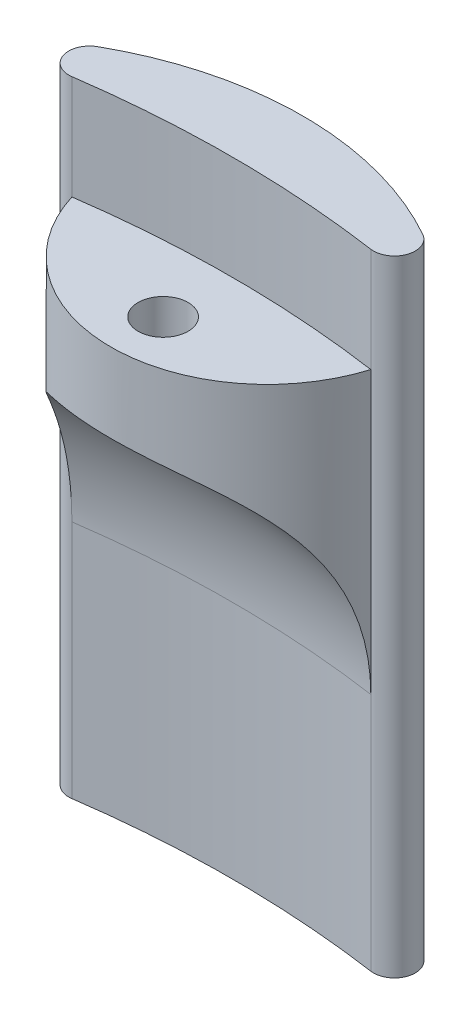
ISO-10303-21;
HEADER;
FILE_DESCRIPTION(('STEP AP214'),'2;1');
FILE_NAME('part.step','',(''),(''),'','','');
FILE_SCHEMA(('AUTOMOTIVE_DESIGN { 1 0 10303 214 1 1 1 1 }'));
ENDSEC;
DATA;
#1=APPLICATION_CONTEXT('core data for automotive mechanical design processes');
#2=APPLICATION_PROTOCOL_DEFINITION('international standard','automotive_design',2000,#1);
#3=PRODUCT_CONTEXT('',#1,'mechanical');
#4=PRODUCT('Part','Part','',(#3));
#5=PRODUCT_RELATED_PRODUCT_CATEGORY('part','',(#4));
#6=PRODUCT_DEFINITION_FORMATION('','',#4);
#7=PRODUCT_DEFINITION_CONTEXT('part definition',#1,'design');
#8=PRODUCT_DEFINITION('design','',#6,#7);
#9=PRODUCT_DEFINITION_SHAPE('','',#8);
#10=(LENGTH_UNIT() NAMED_UNIT(*) SI_UNIT(.MILLI.,.METRE.));
#11=(NAMED_UNIT(*) PLANE_ANGLE_UNIT() SI_UNIT($,.RADIAN.));
#12=(NAMED_UNIT(*) SI_UNIT($,.STERADIAN.) SOLID_ANGLE_UNIT());
#13=UNCERTAINTY_MEASURE_WITH_UNIT(LENGTH_MEASURE(1.E-05),#10,'distance_accuracy_value','');
#14=(GEOMETRIC_REPRESENTATION_CONTEXT(3) GLOBAL_UNCERTAINTY_ASSIGNED_CONTEXT((#13)) GLOBAL_UNIT_ASSIGNED_CONTEXT((#10,
#11,#12)) REPRESENTATION_CONTEXT('',''));
#15=CARTESIAN_POINT('',(0.,0.,0.));
#16=DIRECTION('',(0.,0.,1.));
#17=DIRECTION('',(1.,0.,0.));
#18=AXIS2_PLACEMENT_3D('',#15,#16,#17);
#19=CARTESIAN_POINT('',(0.,-50.,0.));
#20=DIRECTION('',(0.,1.,0.));
#21=DIRECTION('',(0.,0.,1.));
#22=AXIS2_PLACEMENT_3D('',#19,#20,#21);
#23=CYLINDRICAL_SURFACE('',#22,101.0285);
#24=DIRECTION('',(0.,1.,0.));
#25=VECTOR('',#24,1.);
#26=CARTESIAN_POINT('',(14.3413827466054,-50.,-100.005412619345));
#27=LINE('',#26,#25);
#28=CARTESIAN_POINT('',(14.3413827466054,-50.,-100.005412619345));
#29=VERTEX_POINT('',#28);
#30=CARTESIAN_POINT('',(14.3413827466054,-27.,-100.005412619345));
#31=VERTEX_POINT('',#30);
#32=EDGE_CURVE('E105',#29,#31,#27,.T.);
#33=ORIENTED_EDGE('',*,*,#32,.T.);
#34=CARTESIAN_POINT('',(0.,-27.,0.));
#35=DIRECTION('',(0.,1.,0.));
#36=DIRECTION('',(0.,0.,1.));
#37=AXIS2_PLACEMENT_3D('',#34,#35,#36);
#38=CIRCLE('',#37,101.0285);
#39=CARTESIAN_POINT('',(-14.3413827466054,-27.,-100.005412619345));
#40=VERTEX_POINT('',#39);
#41=EDGE_CURVE('E47',#31,#40,#38,.T.);
#42=ORIENTED_EDGE('',*,*,#41,.T.);
#43=DIRECTION('',(0.,1.,0.));
#44=VECTOR('',#43,1.);
#45=CARTESIAN_POINT('',(-14.3413827466054,-50.,-100.005412619345));
#46=LINE('',#45,#44);
#47=CARTESIAN_POINT('',(-14.3413827466054,-50.,-100.005412619345));
#48=VERTEX_POINT('',#47);
#49=EDGE_CURVE('E118',#40,#48,#46,.F.);
#50=ORIENTED_EDGE('',*,*,#49,.T.);
#51=CARTESIAN_POINT('',(0.,-50.,0.));
#52=DIRECTION('',(0.,-1.,0.));
#53=DIRECTION('',(0.,0.,-1.));
#54=AXIS2_PLACEMENT_3D('',#51,#52,#53);
#55=CIRCLE('',#54,101.0285);
#56=EDGE_CURVE('E121',#48,#29,#55,.T.);
#57=ORIENTED_EDGE('',*,*,#56,.T.);
#58=EDGE_LOOP('',(#33,#42,#50,#57));
#59=FACE_BOUND('',#58,.T.);
#60=ADVANCED_FACE('F33',(#59),#23,.F.);
#61=CARTESIAN_POINT('',(0.,-50.,-76.0285));
#62=DIRECTION('',(0.,1.,0.));
#63=DIRECTION('',(0.,0.,1.));
#64=AXIS2_PLACEMENT_3D('',#61,#62,#63);
#65=CYLINDRICAL_SURFACE('',#64,31.7934099309613);
#66=CARTESIAN_POINT('',(0.,10.,-76.0285));
#67=DIRECTION('',(0.,1.,0.));
#68=DIRECTION('',(0.,0.,-1.));
#69=AXIS2_PLACEMENT_3D('',#66,#67,#68);
#70=CIRCLE('',#69,31.7934099309613);
#71=CARTESIAN_POINT('',(15.60707064013,10.,-103.727602170867));
#72=VERTEX_POINT('',#71);
#73=CARTESIAN_POINT('',(-15.60707064013,10.,-103.727602170867));
#74=VERTEX_POINT('',#73);
#75=EDGE_CURVE('E99',#72,#74,#70,.T.);
#76=ORIENTED_EDGE('',*,*,#75,.F.);
#77=DIRECTION('',(0.,1.,0.));
#78=VECTOR('',#77,1.);
#79=CARTESIAN_POINT('',(15.60707064013,-50.,-103.727602170867));
#80=LINE('',#79,#78);
#81=CARTESIAN_POINT('',(15.60707064013,-50.,-103.727602170867));
#82=VERTEX_POINT('',#81);
#83=EDGE_CURVE('E128',#72,#82,#80,.F.);
#84=ORIENTED_EDGE('',*,*,#83,.T.);
#85=CARTESIAN_POINT('',(0.,-50.,-76.0285));
#86=DIRECTION('',(0.,1.,0.));
#87=DIRECTION('',(0.,0.,-1.));
#88=AXIS2_PLACEMENT_3D('',#85,#86,#87);
#89=CIRCLE('',#88,31.7934099309613);
#90=CARTESIAN_POINT('',(-15.60707064013,-50.,-103.727602170867));
#91=VERTEX_POINT('',#90);
#92=EDGE_CURVE('E113',#82,#91,#89,.T.);
#93=ORIENTED_EDGE('',*,*,#92,.T.);
#94=DIRECTION('',(0.,1.,0.));
#95=VECTOR('',#94,1.);
#96=CARTESIAN_POINT('',(-15.60707064013,-50.,-103.727602170867));
#97=LINE('',#96,#95);
#98=EDGE_CURVE('E126',#91,#74,#97,.T.);
#99=ORIENTED_EDGE('',*,*,#98,.T.);
#100=EDGE_LOOP('',(#76,#84,#93,#99));
#101=FACE_BOUND('',#100,.T.);
#102=ADVANCED_FACE('F155',(#101),#65,.T.);
#103=CARTESIAN_POINT('',(0.,0.,0.));
#104=DIRECTION('',(0.,1.,0.));
#105=DIRECTION('',(0.,0.,1.));
#106=AXIS2_PLACEMENT_3D('',#103,#104,#105);
#107=CIRCLE('',#106,101.0285);
#108=CARTESIAN_POINT('',(14.3413827466054,0.,-100.005412619345));
#109=VERTEX_POINT('',#108);
#110=CARTESIAN_POINT('',(-14.3413827466054,0.,-100.005412619345));
#111=VERTEX_POINT('',#110);
#112=EDGE_CURVE('E181',#109,#111,#107,.T.);
#113=ORIENTED_EDGE('',*,*,#112,.F.);
#114=CARTESIAN_POINT('',(14.3413827466054,10.,-100.005412619345));
#115=VERTEX_POINT('',#114);
#116=EDGE_CURVE('E111',#109,#115,#27,.T.);
#117=ORIENTED_EDGE('',*,*,#116,.T.);
#118=CARTESIAN_POINT('',(0.,10.,0.));
#119=DIRECTION('',(0.,-1.,0.));
#120=DIRECTION('',(0.,0.,-1.));
#121=AXIS2_PLACEMENT_3D('',#118,#119,#120);
#122=CIRCLE('',#121,101.0285);
#123=CARTESIAN_POINT('',(-14.3413827466054,10.,-100.005412619345));
#124=VERTEX_POINT('',#123);
#125=EDGE_CURVE('E97',#124,#115,#122,.T.);
#126=ORIENTED_EDGE('',*,*,#125,.F.);
#127=EDGE_CURVE('E110',#124,#111,#46,.F.);
#128=ORIENTED_EDGE('',*,*,#127,.T.);
#129=EDGE_LOOP('',(#113,#117,#126,#128));
#130=FACE_BOUND('',#129,.T.);
#131=ADVANCED_FACE('F109',(#130),#23,.F.);
#132=CARTESIAN_POINT('',(0.,-50.,-38.01425));
#133=DIRECTION('',(0.,-1.,0.));
#134=DIRECTION('',(0.,0.,-1.));
#135=AXIS2_PLACEMENT_3D('',#132,#133,#134);
#136=PLANE('',#135);
#137=ORIENTED_EDGE('',*,*,#92,.F.);
#138=CARTESIAN_POINT('',(14.6252904112071,-50.,-101.985159178372));
#139=DIRECTION('',(0.,-1.,0.));
#140=DIRECTION('',(0.,0.,-1.));
#141=AXIS2_PLACEMENT_3D('',#138,#139,#140);
#142=CIRCLE('',#141,2.);
#143=EDGE_CURVE('E132',#82,#29,#142,.T.);
#144=ORIENTED_EDGE('',*,*,#143,.T.);
#145=ORIENTED_EDGE('',*,*,#56,.F.);
#146=CARTESIAN_POINT('',(-14.6252904112071,-50.,-101.985159178372));
#147=DIRECTION('',(0.,-1.,0.));
#148=DIRECTION('',(0.,0.,-1.));
#149=AXIS2_PLACEMENT_3D('',#146,#147,#148);
#150=CIRCLE('',#149,2.);
#151=EDGE_CURVE('E130',#48,#91,#150,.T.);
#152=ORIENTED_EDGE('',*,*,#151,.T.);
#153=EDGE_LOOP('',(#137,#144,#145,#152));
#154=FACE_BOUND('',#153,.T.);
#155=ADVANCED_FACE('F149',(#154),#136,.T.);
#156=CARTESIAN_POINT('',(0.,10.,-38.01425));
#157=DIRECTION('',(0.,-1.,0.));
#158=DIRECTION('',(0.,0.,-1.));
#159=AXIS2_PLACEMENT_3D('',#156,#157,#158);
#160=PLANE('',#159);
#161=ORIENTED_EDGE('',*,*,#125,.T.);
#162=CARTESIAN_POINT('',(14.6252904112071,10.,-101.985159178372));
#163=DIRECTION('',(0.,-1.,0.));
#164=DIRECTION('',(0.,0.,-1.));
#165=AXIS2_PLACEMENT_3D('',#162,#163,#164);
#166=CIRCLE('',#165,2.);
#167=EDGE_CURVE('E104',#115,#72,#166,.F.);
#168=ORIENTED_EDGE('',*,*,#167,.T.);
#169=ORIENTED_EDGE('',*,*,#75,.T.);
#170=CARTESIAN_POINT('',(-14.6252904112071,10.,-101.985159178372));
#171=DIRECTION('',(0.,-1.,0.));
#172=DIRECTION('',(0.,0.,-1.));
#173=AXIS2_PLACEMENT_3D('',#170,#171,#172);
#174=CIRCLE('',#173,2.);
#175=EDGE_CURVE('E94',#74,#124,#174,.F.);
#176=ORIENTED_EDGE('',*,*,#175,.T.);
#177=EDGE_LOOP('',(#161,#168,#169,#176));
#178=FACE_BOUND('',#177,.T.);
#179=ADVANCED_FACE('F96',(#178),#160,.F.);
#180=CARTESIAN_POINT('',(14.6252904112071,-50.,-101.985159178372));
#181=DIRECTION('',(0.,-1.,0.));
#182=DIRECTION('',(0.,0.,-1.));
#183=AXIS2_PLACEMENT_3D('',#180,#181,#182);
#184=CYLINDRICAL_SURFACE('',#183,2.);
#185=ORIENTED_EDGE('',*,*,#143,.F.);
#186=ORIENTED_EDGE('',*,*,#83,.F.);
#187=ORIENTED_EDGE('',*,*,#167,.F.);
#188=ORIENTED_EDGE('',*,*,#116,.F.);
#189=DIRECTION('',(0.,1.,0.));
#190=VECTOR('',#189,1.);
#191=CARTESIAN_POINT('',(14.3413827466054,-5.,-100.005412619345));
#192=LINE('',#191,#190);
#193=EDGE_CURVE('E54',#31,#109,#192,.T.);
#194=ORIENTED_EDGE('',*,*,#193,.F.);
#195=ORIENTED_EDGE('',*,*,#32,.F.);
#196=EDGE_LOOP('',(#185,#186,#187,#188,#194,#195));
#197=FACE_BOUND('',#196,.T.);
#198=ADVANCED_FACE('F148',(#197),#184,.T.);
#199=CARTESIAN_POINT('',(-14.6252904112071,-50.,-101.985159178372));
#200=DIRECTION('',(0.,-1.,0.));
#201=DIRECTION('',(0.,0.,-1.));
#202=AXIS2_PLACEMENT_3D('',#199,#200,#201);
#203=CYLINDRICAL_SURFACE('',#202,2.);
#204=ORIENTED_EDGE('',*,*,#151,.F.);
#205=ORIENTED_EDGE('',*,*,#49,.F.);
#206=DIRECTION('',(0.,1.,0.));
#207=VECTOR('',#206,1.);
#208=CARTESIAN_POINT('',(-14.3413827466054,-5.,-100.005412619345));
#209=LINE('',#208,#207);
#210=EDGE_CURVE('E61',#40,#111,#209,.T.);
#211=ORIENTED_EDGE('',*,*,#210,.T.);
#212=ORIENTED_EDGE('',*,*,#127,.F.);
#213=ORIENTED_EDGE('',*,*,#175,.F.);
#214=ORIENTED_EDGE('',*,*,#98,.F.);
#215=EDGE_LOOP('',(#204,#205,#211,#212,#213,#214));
#216=FACE_BOUND('',#215,.T.);
#217=ADVANCED_FACE('F116',(#216),#203,.T.);
#218=CARTESIAN_POINT('',(0.,-5.,-104.401404079228));
#219=DIRECTION('',(0.,1.,0.));
#220=DIRECTION('',(0.,0.,1.));
#221=AXIS2_PLACEMENT_3D('',#218,#219,#220);
#222=CYLINDRICAL_SURFACE('',#221,15.);
#223=CARTESIAN_POINT('',(0.,0.,-104.401404079228));
#224=DIRECTION('',(0.,1.,0.));
#225=DIRECTION('',(0.,0.,1.));
#226=AXIS2_PLACEMENT_3D('',#223,#224,#225);
#227=CIRCLE('',#226,15.);
#228=EDGE_CURVE('E179',#111,#109,#227,.T.);
#229=ORIENTED_EDGE('',*,*,#228,.F.);
#230=ORIENTED_EDGE('',*,*,#210,.F.);
#231=CARTESIAN_POINT('',(-14.3413827466054,-27.,-100.005412619345));
#232=CARTESIAN_POINT('',(-14.3413631932165,-26.6816898166187,-100.005420580762));
#233=CARTESIAN_POINT('',(-14.3393329082881,-26.3633791159884,-99.998727813174));
#234=CARTESIAN_POINT('',(-14.3311103214102,-25.7273673903211,-99.9719976339996));
#235=CARTESIAN_POINT('',(-14.3249179530532,-25.4096663750929,-99.9519600094919));
#236=CARTESIAN_POINT('',(-14.3082260713841,-24.7753214180974,-99.8985823337413));
#237=CARTESIAN_POINT('',(-14.2977242030569,-24.458678149889,-99.8652350094122));
#238=CARTESIAN_POINT('',(-14.2721351305645,-23.8272473353891,-99.7853527814481));
#239=CARTESIAN_POINT('',(-14.2570479577699,-23.5124597764168,-99.7388179680362));
#240=CARTESIAN_POINT('',(-14.221826805897,-22.8838577446372,-99.6324636840357));
#241=CARTESIAN_POINT('',(-14.2016689146282,-22.5700552239952,-99.5725814272553));
#242=CARTESIAN_POINT('',(-14.1558523598547,-21.9456048307021,-99.4398749924947));
#243=CARTESIAN_POINT('',(-14.1301937191923,-21.6349569449567,-99.3670508682567));
#244=CARTESIAN_POINT('',(-14.0727906203606,-21.0175683097104,-99.2087501844469));
#245=CARTESIAN_POINT('',(-14.0410480900494,-20.7108263552502,-99.1232776348481));
#246=CARTESIAN_POINT('',(-13.9707818231885,-20.1018665909963,-98.9400060968058));
#247=CARTESIAN_POINT('',(-13.9322584405022,-19.7996485460117,-98.8422077516682));
#248=CARTESIAN_POINT('',(-13.8225262321557,-19.0224983824788,-98.5730441229266));
#249=CARTESIAN_POINT('',(-13.7454886666062,-18.551521663952,-98.3924672250878));
#250=CARTESIAN_POINT('',(-13.5685804848779,-17.6258446318631,-98.0030194499642));
#251=CARTESIAN_POINT('',(-13.4687107501726,-17.1711436907313,-97.7941496650995));
#252=CARTESIAN_POINT('',(-13.2423529080155,-16.2825179242298,-97.35145970463));
#253=CARTESIAN_POINT('',(-13.1159403308257,-15.8485383458467,-97.1177112351061));
#254=CARTESIAN_POINT('',(-12.8320074987811,-15.0036537561574,-96.628403942811));
#255=CARTESIAN_POINT('',(-12.6744943221252,-14.5927435217685,-96.3728500902376));
#256=CARTESIAN_POINT('',(-12.3606536393295,-13.8808098213594,-95.8998109660127));
#257=CARTESIAN_POINT('',(-12.210935922211,-13.5747472621386,-95.6855080394965));
#258=CARTESIAN_POINT('',(-11.8873897282129,-12.9814481904325,-95.2491524574317));
#259=CARTESIAN_POINT('',(-11.7135641801348,-12.6942093973264,-95.0271007457128));
#260=CARTESIAN_POINT('',(-11.340244459496,-12.1405917653624,-94.5787829914094));
#261=CARTESIAN_POINT('',(-11.1407591951651,-11.8742057384797,-94.3525184345957));
#262=CARTESIAN_POINT('',(-10.7149763550761,-11.3639860719924,-93.8996979178754));
#263=CARTESIAN_POINT('',(-10.4886785471926,-11.1201526276659,-93.673141955463));
#264=CARTESIAN_POINT('',(-10.0071873259693,-10.6549334946823,-93.2226014322286));
#265=CARTESIAN_POINT('',(-9.75180246382645,-10.4337171577589,-92.9986460323514));
#266=CARTESIAN_POINT('',(-9.2138604029178,-10.0167947253477,-92.5597298457162));
#267=CARTESIAN_POINT('',(-8.93130273168244,-9.82108907356843,-92.3447692154489));
#268=CARTESIAN_POINT('',(-8.34030586909448,-9.45571323964803,-91.9286374757873));
#269=CARTESIAN_POINT('',(-8.03186425884125,-9.2860454949965,-91.7274676583682));
#270=CARTESIAN_POINT('',(-7.39126662291357,-8.97271967760825,-91.343511303102));
#271=CARTESIAN_POINT('',(-7.0591133548389,-8.82905858721876,-91.1607226335146));
#272=CARTESIAN_POINT('',(-6.41409889309305,-8.58250220744388,-90.8377099141192));
#273=CARTESIAN_POINT('',(-6.10354214246187,-8.47680210068709,-90.6950080620225));
#274=CARTESIAN_POINT('',(-5.46834869887698,-8.28451621299774,-90.4294449726715));
#275=CARTESIAN_POINT('',(-5.14371236681549,-8.19792994247941,-90.3065832272502));
#276=CARTESIAN_POINT('',(-4.48309325910627,-8.04316213589522,-90.0827666135919));
#277=CARTESIAN_POINT('',(-4.14712210451356,-7.9749623577211,-89.9817900516836));
#278=CARTESIAN_POINT('',(-3.46612894066673,-7.85606922626146,-89.8031200349761));
#279=CARTESIAN_POINT('',(-3.12110889667152,-7.8053721050345,-89.7254215693856));
#280=CARTESIAN_POINT('',(-2.31816729734788,-7.70783546131687,-89.5744058286564));
#281=CARTESIAN_POINT('',(-1.8578869340033,-7.66688170929665,-89.5096424499057));
#282=CARTESIAN_POINT('',(-0.931707497380456,-7.61241058932106,-89.4231445684842));
#283=CARTESIAN_POINT('',(-0.46580849372973,-7.59889288172236,-89.4014095331462));
#284=CARTESIAN_POINT('',(0.353459093259869,-7.59889725364028,-89.4013999407528));
#285=CARTESIAN_POINT('',(0.706866071885127,-7.60668392107008,-89.4139074604841));
#286=CARTESIAN_POINT('',(1.41133560249655,-7.63796999316795,-89.4637737701058));
#287=CARTESIAN_POINT('',(1.76239758892339,-7.66147305924366,-89.5011383508692));
#288=CARTESIAN_POINT('',(2.4599352102516,-7.72460448289124,-89.600290952806));
#289=CARTESIAN_POINT('',(2.80640606239951,-7.76424847110981,-89.6621026465638));
#290=CARTESIAN_POINT('',(3.49192741539629,-7.86025059535817,-89.8093060327585));
#291=CARTESIAN_POINT('',(3.8309783907575,-7.91660765918765,-89.8946962125317));
#292=CARTESIAN_POINT('',(4.49939898909516,-8.04680453892567,-90.0878965973469));
#293=CARTESIAN_POINT('',(4.82876338512685,-8.1206536058834,-90.1957186623252));
#294=CARTESIAN_POINT('',(5.47521733619013,-8.28660743593393,-90.4321364119705));
#295=CARTESIAN_POINT('',(5.79230678876866,-8.37871235136026,-90.56073226998));
#296=CARTESIAN_POINT('',(6.41173911866257,-8.58185632471172,-90.8365789302293));
#297=CARTESIAN_POINT('',(6.71409034947156,-8.69288449278639,-90.9838189907473));
#298=CARTESIAN_POINT('',(7.30215628351471,-8.93448782221699,-91.294569658057));
#299=CARTESIAN_POINT('',(7.58787129500957,-9.06506262122357,-91.458079963217));
#300=CARTESIAN_POINT('',(8.13735637075214,-9.34428382018463,-91.7963969035133));
#301=CARTESIAN_POINT('',(8.4013604298596,-9.49267764039683,-91.9710322501729));
#302=CARTESIAN_POINT('',(8.91011176104518,-9.8088333455182,-92.3304916442632));
#303=CARTESIAN_POINT('',(9.15485929980462,-9.97659496212559,-92.5153155505332));
#304=CARTESIAN_POINT('',(9.6242493486355,-10.3311726829948,-92.8920854011153));
#305=CARTESIAN_POINT('',(9.84889063132539,-10.5179899490168,-93.0840317792064));
#306=CARTESIAN_POINT('',(10.2776782587928,-10.9100318235555,-93.4719513312369));
#307=CARTESIAN_POINT('',(10.4818239136755,-11.115257051255,-93.6679246404577));
#308=CARTESIAN_POINT('',(10.8762921099859,-11.5504648184449,-94.0675873341183));
#309=CARTESIAN_POINT('',(11.0659109065034,-11.781050993562,-94.2713129711997));
#310=CARTESIAN_POINT('',(11.4239153352404,-12.2596895277611,-94.6768303543918));
#311=CARTESIAN_POINT('',(11.5923009323812,-12.5077419156974,-94.8786220973071));
#312=CARTESIAN_POINT('',(11.908900064835,-13.0200698050348,-95.2776434401413));
#313=CARTESIAN_POINT('',(12.0571040796489,-13.2843528784187,-95.4748708507084));
#314=CARTESIAN_POINT('',(12.3345384171422,-13.8276326202571,-95.8623203324046));
#315=CARTESIAN_POINT('',(12.4637649343172,-14.1066322245723,-96.0525409927761));
#316=CARTESIAN_POINT('',(12.75584996472,-14.7992530839739,-96.5028089134656));
#317=CARTESIAN_POINT('',(12.9096899019294,-15.2197337274057,-96.7582092625768));
#318=CARTESIAN_POINT('',(13.1862761447826,-16.0837229472891,-97.2459315168091));
#319=CARTESIAN_POINT('',(13.3090113106815,-16.5272397054801,-97.478245135681));
#320=CARTESIAN_POINT('',(13.5280066941875,-17.4343247863003,-97.9165629928574));
#321=CARTESIAN_POINT('',(13.6242212081335,-17.8979261502531,-98.1225214896377));
#322=CARTESIAN_POINT('',(13.7940446878009,-18.841036692538,-98.5049552458728));
#323=CARTESIAN_POINT('',(13.8676561019279,-19.3205441416573,-98.6814336977102));
#324=CARTESIAN_POINT('',(13.9969610608234,-20.3000931227026,-99.0054796184922));
#325=CARTESIAN_POINT('',(14.0523538942341,-20.8003391841934,-99.15254754498));
#326=CARTESIAN_POINT('',(14.1468064219465,-21.8111593480078,-99.4127141562437));
#327=CARTESIAN_POINT('',(14.1858637966365,-22.3217349063209,-99.5258080161085));
#328=CARTESIAN_POINT('',(14.2500476297613,-23.3492637900165,-99.7167207837017));
#329=CARTESIAN_POINT('',(14.2752004567075,-23.8662031298552,-99.7946064086398));
#330=CARTESIAN_POINT('',(14.3133943653397,-24.9044769626297,-99.9146740475266));
#331=CARTESIAN_POINT('',(14.3264409819865,-25.425809336946,-99.9568723769286));
#332=CARTESIAN_POINT('',(14.3363975037868,-26.1232159352847,-99.9891785353699));
#333=CARTESIAN_POINT('',(14.33826965223,-26.2985915575316,-99.995268279485));
#334=CARTESIAN_POINT('',(14.3407615040422,-26.6493067927919,-100.003383364744));
#335=CARTESIAN_POINT('',(14.3413821978066,-26.8246463243888,-100.005411919885));
#336=CARTESIAN_POINT('',(14.3413827466054,-27.,-100.005412619345));
#337=B_SPLINE_CURVE_WITH_KNOTS('',3,(#231,#232,#233,#234,#235,#236,#237,#238,#239,#240,#241,
#242,#243,#244,#245,#246,#247,#248,#249,#250,#251,#252,#253,#254,#255,#256,#257,#258,#259,#260,
#261,#262,#263,#264,#265,#266,#267,#268,#269,#270,#271,#272,#273,#274,#275,#276,#277,#278,#279,
#280,#281,#282,#283,#284,#285,#286,#287,#288,#289,#290,#291,#292,#293,#294,#295,#296,#297,#298,
#299,#300,#301,#302,#303,#304,#305,#306,#307,#308,#309,#310,#311,#312,#313,#314,#315,#316,#317,
#318,#319,#320,#321,#322,#323,#324,#325,#326,#327,#328,#329,#330,#331,#332,#333,#334,#335,#336),
.UNSPECIFIED.,.F.,.F.,(4,2,2,2,2,2,2,2,2,2,2,2,2,2,2,2,2,2,2,2,2,2,2,2,2,2,2,2,2,2,2,2,2,2,2,2,
2,2,2,2,2,2,2,2,2,2,2,2,2,2,2,2,4),(0.,0.954854614710329,1.90972446481472,2.8651168195628,
3.82050263807586,4.78048115521097,5.74045568605288,6.70012652236622,7.65974729241955,
9.1889403287494,10.7180743380378,12.2429146283628,13.7674082788155,14.9738193762938,
16.1800840380114,17.3859310479581,18.5917884981051,19.8060995202317,21.0204316601158,
22.2348774081647,23.4491821489218,24.5211067379751,25.5930038673429,26.6638335701446,
27.7344326026389,29.1313519970746,30.5282540983022,31.5882342333127,32.6484613951514,
33.7097177176629,34.7709059717166,35.8326567177491,36.8944163237945,37.9555669646319,
39.0166979366246,40.0642528804186,41.1117933141911,42.1593976512646,43.2070372394984,
44.2902120724191,45.3733886947954,46.4570745398561,47.5409773975424,49.0851210488069,
50.6298169348048,52.1771584210444,53.7243322374908,55.2958927478358,56.8676763418254,
58.4364688977212,60.0045438475493,60.5309805236623,61.0570004165194),.UNSPECIFIED.);
#338=EDGE_CURVE('E11',#40,#31,#337,.T.);
#339=ORIENTED_EDGE('',*,*,#338,.T.);
#340=ORIENTED_EDGE('',*,*,#193,.T.);
#341=EDGE_LOOP('',(#229,#230,#339,#340));
#342=FACE_BOUND('',#341,.T.);
#343=ADVANCED_FACE('F140',(#342),#222,.T.);
#344=CARTESIAN_POINT('',(0.,0.,-52.200702039614));
#345=DIRECTION('',(0.,1.,0.));
#346=DIRECTION('',(0.,0.,1.));
#347=AXIS2_PLACEMENT_3D('',#344,#345,#346);
#348=PLANE('',#347);
#349=CARTESIAN_POINT('',(0.,0.,-94.415));
#350=DIRECTION('',(0.,1.,0.));
#351=DIRECTION('',(0.,0.,1.));
#352=AXIS2_PLACEMENT_3D('',#349,#350,#351);
#353=CIRCLE('',#352,2.4);
#354=CARTESIAN_POINT('',(0.,0.,-92.015));
#355=VERTEX_POINT('',#354);
#356=EDGE_CURVE('E180',#355,#355,#353,.T.);
#357=ORIENTED_EDGE('',*,*,#356,.F.);
#358=EDGE_LOOP('',(#357));
#359=FACE_BOUND('',#358,.T.);
#360=ORIENTED_EDGE('',*,*,#228,.T.);
#361=ORIENTED_EDGE('',*,*,#112,.T.);
#362=EDGE_LOOP('',(#360,#361));
#363=FACE_BOUND('',#362,.T.);
#364=ADVANCED_FACE('F145',(#359,#363),#348,.T.);
#365=CARTESIAN_POINT('',(0.,-5.,-94.415));
#366=DIRECTION('',(0.,1.,0.));
#367=DIRECTION('',(0.,0.,1.));
#368=AXIS2_PLACEMENT_3D('',#365,#366,#367);
#369=CYLINDRICAL_SURFACE('',#368,2.4);
#370=CARTESIAN_POINT('',(0.,-14.0523972199484,-96.815));
#371=CARTESIAN_POINT('',(-0.0496360089396286,-14.0523963023315,-96.814999374118));
#372=CARTESIAN_POINT('',(-0.0992830841149895,-14.0503254081636,-96.8134541228893));
#373=CARTESIAN_POINT('',(-0.19806313959983,-14.0421231539956,-96.8073271531627));
#374=CARTESIAN_POINT('',(-0.24719574812377,-14.0359890391096,-96.8027433745251));
#375=CARTESIAN_POINT('',(-0.393286990399856,-14.0117250395041,-96.7845833519266));
#376=CARTESIAN_POINT('',(-0.488795563759362,-13.98773432209,-96.7665989548521));
#377=CARTESIAN_POINT('',(-0.671754569657058,-13.9272736085413,-96.7209887602606));
#378=CARTESIAN_POINT('',(-0.759286946454661,-13.890954560989,-96.6934795075007));
#379=CARTESIAN_POINT('',(-0.926607912666867,-13.8087288409834,-96.630712137394));
#380=CARTESIAN_POINT('',(-1.00639529432186,-13.7628206767038,-96.5954528142857));
#381=CARTESIAN_POINT('',(-1.20411926097525,-13.6339393141203,-96.4955685276661));
#382=CARTESIAN_POINT('',(-1.3159128333946,-13.5453513555102,-96.4260874979458));
#383=CARTESIAN_POINT('',(-1.52105648487751,-13.3569807587825,-96.275811951461));
#384=CARTESIAN_POINT('',(-1.61434945660872,-13.2571649042119,-96.194983680417));
#385=CARTESIAN_POINT('',(-1.76334766574134,-13.0759820414787,-96.0455933533736));
#386=CARTESIAN_POINT('',(-1.82267312425111,-12.9960442796645,-95.978839869259));
#387=CARTESIAN_POINT('',(-1.93227962384022,-12.8335034462952,-95.8411985698196));
#388=CARTESIAN_POINT('',(-1.98255618019709,-12.7508990769305,-95.7703087273963));
#389=CARTESIAN_POINT('',(-2.07445939655672,-12.5839468937517,-95.6249640864574));
#390=CARTESIAN_POINT('',(-2.11608035151281,-12.4995979700826,-95.5505069762205));
#391=CARTESIAN_POINT('',(-2.19084785068668,-12.3299397520229,-95.3985422118601));
#392=CARTESIAN_POINT('',(-2.22399572055313,-12.2446306100455,-95.321035037124));
#393=CARTESIAN_POINT('',(-2.28280695035599,-12.0709164998678,-95.1608537627993));
#394=CARTESIAN_POINT('',(-2.30820043041421,-11.9824989544371,-95.0780937764665));
#395=CARTESIAN_POINT('',(-2.34996026119205,-11.8058175019806,-94.9101544583927));
#396=CARTESIAN_POINT('',(-2.3663232714745,-11.7175536638309,-94.8249742436259));
#397=CARTESIAN_POINT('',(-2.40150535457271,-11.4539500492276,-94.5665846951894));
#398=CARTESIAN_POINT('',(-2.4065145484508,-11.2795117332443,-94.3902628594845));
#399=CARTESIAN_POINT('',(-2.37838926452341,-10.9613556257673,-94.0585631160203));
#400=CARTESIAN_POINT('',(-2.35039223371755,-10.8167058443386,-93.9036295822368));
#401=CARTESIAN_POINT('',(-2.26132984100874,-10.5361428824228,-93.5951981285795));
#402=CARTESIAN_POINT('',(-2.20030403820995,-10.400219467636,-93.4416987143167));
#403=CARTESIAN_POINT('',(-2.06054943604743,-10.1720920457063,-93.1777096579879));
#404=CARTESIAN_POINT('',(-1.98937838282285,-10.0771322943164,-93.0656069698851));
#405=CARTESIAN_POINT('',(-1.82452735320992,-9.89756446371643,-92.8499251230692));
#406=CARTESIAN_POINT('',(-1.73087789194418,-9.8129425835392,-92.7463346624898));
#407=CARTESIAN_POINT('',(-1.5407563963546,-9.67203879003363,-92.571238584678));
#408=CARTESIAN_POINT('',(-1.4481947601899,-9.61342647574976,-92.4973752076621));
#409=CARTESIAN_POINT('',(-1.24879008889373,-9.50705906116755,-92.3619481827007));
#410=CARTESIAN_POINT('',(-1.14195117982949,-9.45930083481595,-92.3003809939878));
#411=CARTESIAN_POINT('',(-0.915001288820472,-9.3764028740497,-92.192690680617));
#412=CARTESIAN_POINT('',(-0.794793607387717,-9.34136409814145,-92.1466913095655));
#413=CARTESIAN_POINT('',(-0.54536300010806,-9.28638342462399,-92.074189430976));
#414=CARTESIAN_POINT('',(-0.416148105625692,-9.26642826097551,-92.0476697915918));
#415=CARTESIAN_POINT('',(-0.171294229282346,-9.24441014194628,-92.0183805627403));
#416=CARTESIAN_POINT('',(-0.0561544341478891,-9.24030903285985,-92.0129060957601));
#417=CARTESIAN_POINT('',(0.173467852115186,-9.24452735462667,-92.0185277044276));
#418=CARTESIAN_POINT('',(0.287950566481399,-9.25284228151767,-92.0296177712308));
#419=CARTESIAN_POINT('',(0.506262250019755,-9.28065140086362,-92.0665396302808));
#420=CARTESIAN_POINT('',(0.610327044601323,-9.29948399868916,-92.0914985952293));
#421=CARTESIAN_POINT('',(0.812150124906425,-9.34703452861728,-92.1541193631244));
#422=CARTESIAN_POINT('',(0.90990768354824,-9.37575359799747,-92.1917826274838));
#423=CARTESIAN_POINT('',(1.10265616406653,-9.44396375327737,-92.2805089289691));
#424=CARTESIAN_POINT('',(1.1971582237803,-9.48398276289323,-92.3322221596151));
#425=CARTESIAN_POINT('',(1.37560817901075,-9.57256298458631,-92.4455101974223));
#426=CARTESIAN_POINT('',(1.45955185736719,-9.62112759142869,-92.5070889228084));
#427=CARTESIAN_POINT('',(1.62770240380491,-9.73311362082858,-92.6474405831811));
#428=CARTESIAN_POINT('',(1.71014926965656,-9.79766918143486,-92.7274109576586));
#429=CARTESIAN_POINT('',(1.8601916542088,-9.93443272411084,-92.8943705763913));
#430=CARTESIAN_POINT('',(1.92777588787093,-10.0066464597106,-92.9813650859497));
#431=CARTESIAN_POINT('',(2.08002182106633,-10.1964902232025,-93.2065319110853));
#432=CARTESIAN_POINT('',(2.15521359448266,-10.318167976516,-93.3477375887943));
#433=CARTESIAN_POINT('',(2.27480352608276,-10.5713542914041,-93.6343044340271));
#434=CARTESIAN_POINT('',(2.31913772178332,-10.7028826506409,-93.779673586595));
#435=CARTESIAN_POINT('',(2.38809498160533,-11.0097401719138,-94.1103114908111));
#436=CARTESIAN_POINT('',(2.40391138378276,-11.1871460933567,-94.2955287574805));
#437=CARTESIAN_POINT('',(2.39682599553625,-11.4570350068577,-94.5683860910543));
#438=CARTESIAN_POINT('',(2.38930245452104,-11.5477356629423,-94.6586124588721));
#439=CARTESIAN_POINT('',(2.36433354943046,-11.7298591437396,-94.8369284845421));
#440=CARTESIAN_POINT('',(2.34689210606715,-11.8212816690107,-94.9250189724041));
#441=CARTESIAN_POINT('',(2.30205820351807,-12.0054055932169,-95.0996619051718));
#442=CARTESIAN_POINT('',(2.27454295813163,-12.0981085731107,-95.1861809173433));
#443=CARTESIAN_POINT('',(2.20967524815081,-12.2830080509451,-95.3560652912613));
#444=CARTESIAN_POINT('',(2.17232082181404,-12.3752044441356,-95.4394300203097));
#445=CARTESIAN_POINT('',(2.08773086689378,-12.5581618489803,-95.6023474596958));
#446=CARTESIAN_POINT('',(2.04051063638836,-12.6489248516155,-95.6819058401993));
#447=CARTESIAN_POINT('',(1.93585000931631,-12.8281446995936,-95.8366915677398));
#448=CARTESIAN_POINT('',(1.87841520183255,-12.916602775922,-95.9119212536528));
#449=CARTESIAN_POINT('',(1.73959625821238,-13.1081203271596,-96.0725047549731));
#450=CARTESIAN_POINT('',(1.65571551033403,-13.2103738356303,-96.1566943894784));
#451=CARTESIAN_POINT('',(1.47065458277765,-13.4063464854585,-96.3155315890765));
#452=CARTESIAN_POINT('',(1.36949861474497,-13.5000772936078,-96.3901922567716));
#453=CARTESIAN_POINT('',(1.17755299031693,-13.6505284074775,-96.5084350443798));
#454=CARTESIAN_POINT('',(1.09115441462511,-13.7104641119231,-96.5550031299721));
#455=CARTESIAN_POINT('',(0.907641696185555,-13.8195158715308,-96.6390333294019));
#456=CARTESIAN_POINT('',(0.81054274476024,-13.8686469763516,-96.676508116862));
#457=CARTESIAN_POINT('',(0.630308545334883,-13.9420901028153,-96.7321998699268));
#458=CARTESIAN_POINT('',(0.549212426621716,-13.9695189748629,-96.752870639432));
#459=CARTESIAN_POINT('',(0.382540197011764,-14.0133724601359,-96.7858274081556));
#460=CARTESIAN_POINT('',(0.296976775778131,-14.0298265904079,-96.7981358997586));
#461=CARTESIAN_POINT('',(0.175545790260604,-14.0441330162167,-96.8088288675815));
#462=CARTESIAN_POINT('',(0.140559758977073,-14.0472251085751,-96.8111383113926));
#463=CARTESIAN_POINT('',(0.0703843735118529,-14.0513578036818,-96.8142242996876));
#464=CARTESIAN_POINT('',(0.035194968629432,-14.052397870595,-96.8150004437887));
#465=CARTESIAN_POINT('',(0.,-14.0523972199484,-96.815));
#466=B_SPLINE_CURVE_WITH_KNOTS('',3,(#370,#371,#372,#373,#374,#375,#376,#377,#378,#379,#380,
#381,#382,#383,#384,#385,#386,#387,#388,#389,#390,#391,#392,#393,#394,#395,#396,#397,#398,#399,
#400,#401,#402,#403,#404,#405,#406,#407,#408,#409,#410,#411,#412,#413,#414,#415,#416,#417,#418,
#419,#420,#421,#422,#423,#424,#425,#426,#427,#428,#429,#430,#431,#432,#433,#434,#435,#436,#437,
#438,#439,#440,#441,#442,#443,#444,#445,#446,#447,#448,#449,#450,#451,#452,#453,#454,#455,#456,
#457,#458,#459,#460,#461,#462,#463,#464,#465),.UNSPECIFIED.,.T.,.F.,(4,2,2,2,2,2,2,2,2,2,2,2,2,
2,2,2,2,2,2,2,2,2,2,2,2,2,2,2,2,2,2,2,2,2,2,2,2,2,2,2,2,2,2,2,2,2,2,4),(0.,0.148855759455338,
0.297812547375969,0.596148671515926,0.890956365602558,1.18580995858811,1.6591463975811,
2.13392192689641,2.49303872850623,2.85233302465809,3.21186339212389,3.57133747512303,
3.94218104106505,4.31316169298089,5.05393127754795,5.6930989551199,6.33150277970951,
6.81950499888385,7.30684845016464,7.70168088317315,8.09639945716729,8.49418586663645,
8.89162201451554,9.23583616202255,9.57992547492453,9.90447657727736,10.2290650264336,
10.5724690372133,10.9160097755594,11.3098360003676,11.7039602286263,12.3035867703291,
12.9044525632101,13.6710102423935,14.0551836019296,14.4392051968098,14.8280724247747,
15.2170172441094,15.6053633767091,15.9934976691046,16.4626429913996,16.9311361115429,
17.2751057720149,17.6185932412649,17.8818151172331,18.1443261606747,18.2498464554609,
18.355394300589),.UNSPECIFIED.);
#467=CARTESIAN_POINT('',(0.,-14.0523972199484,-96.815));
#468=VERTEX_POINT('',#467);
#469=EDGE_CURVE('E38',#468,#468,#466,.T.);
#470=ORIENTED_EDGE('',*,*,#469,.F.);
#471=EDGE_LOOP('',(#470));
#472=FACE_BOUND('',#471,.T.);
#473=ORIENTED_EDGE('',*,*,#356,.T.);
#474=EDGE_LOOP('',(#473));
#475=FACE_BOUND('',#474,.T.);
#476=ADVANCED_FACE('F175',(#472,#475),#369,.F.);
#477=CARTESIAN_POINT('',(0.,-27.,0.));
#478=DIRECTION('',(0.,1.,0.));
#479=DIRECTION('',(0.,0.,1.));
#480=AXIS2_PLACEMENT_3D('',#477,#478,#479);
#481=TOROIDAL_SURFACE('',#480,79.0285,22.);
#482=ORIENTED_EDGE('',*,*,#41,.F.);
#483=ORIENTED_EDGE('',*,*,#338,.F.);
#484=EDGE_LOOP('',(#482,#483));
#485=FACE_BOUND('',#484,.T.);
#486=ORIENTED_EDGE('',*,*,#469,.T.);
#487=EDGE_LOOP('',(#486));
#488=FACE_BOUND('',#487,.T.);
#489=ADVANCED_FACE('F35',(#485,#488),#481,.F.);
#490=CLOSED_SHELL('',(#60,#102,#131,#155,#179,#198,#217,#343,#364,#476,#489));
#491=MANIFOLD_SOLID_BREP('B2',#490);
#492=ADVANCED_BREP_SHAPE_REPRESENTATION('',(#18,#491),#14);
#493=SHAPE_DEFINITION_REPRESENTATION(#9,#492);
ENDSEC;
END-ISO-10303-21;
